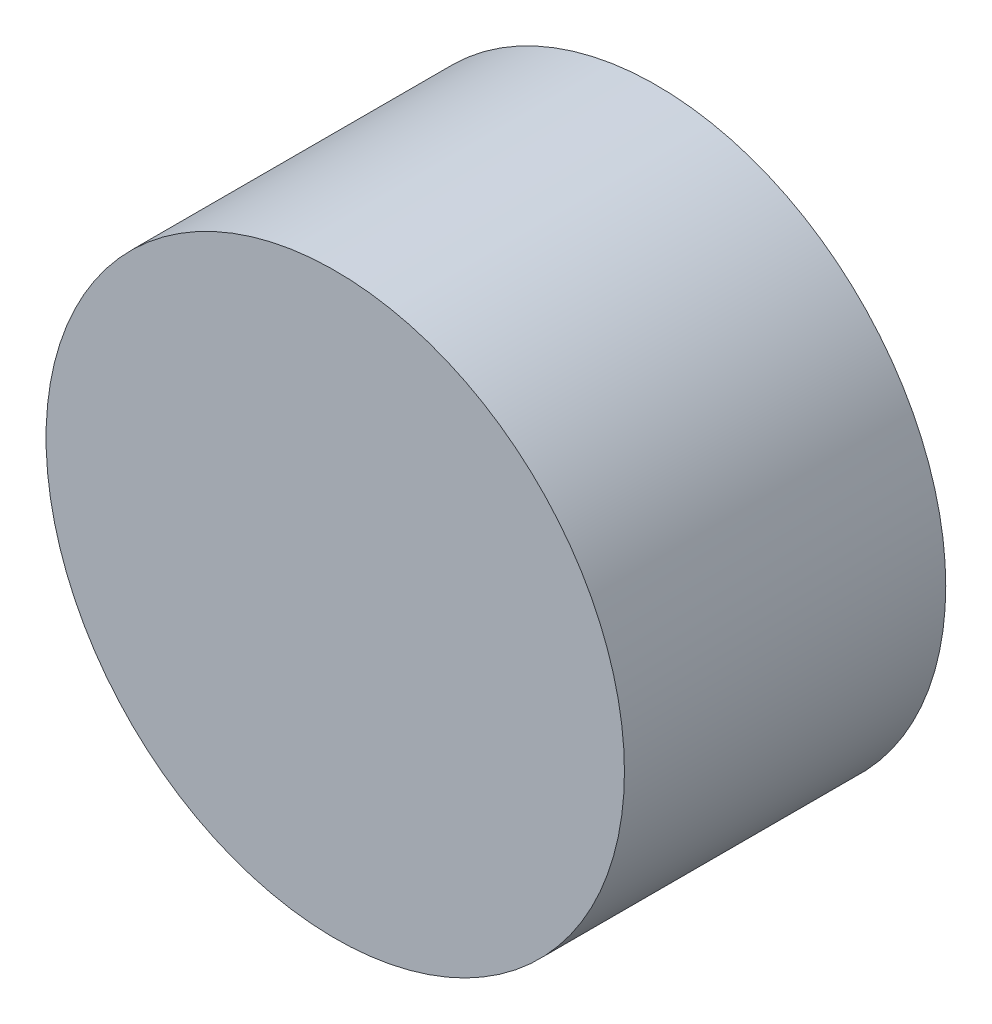
ISO-10303-21;
HEADER;
FILE_DESCRIPTION(('STEP AP214'),'2;1');
FILE_NAME('part.step','',(''),(''),'','','');
FILE_SCHEMA(('AUTOMOTIVE_DESIGN { 1 0 10303 214 1 1 1 1 }'));
ENDSEC;
DATA;
#1=APPLICATION_CONTEXT('core data for automotive mechanical design processes');
#2=APPLICATION_PROTOCOL_DEFINITION('international standard','automotive_design',2000,#1);
#3=PRODUCT_CONTEXT('',#1,'mechanical');
#4=PRODUCT('Part','Part','',(#3));
#5=PRODUCT_RELATED_PRODUCT_CATEGORY('part','',(#4));
#6=PRODUCT_DEFINITION_FORMATION('','',#4);
#7=PRODUCT_DEFINITION_CONTEXT('part definition',#1,'design');
#8=PRODUCT_DEFINITION('design','',#6,#7);
#9=PRODUCT_DEFINITION_SHAPE('','',#8);
#10=(LENGTH_UNIT() NAMED_UNIT(*) SI_UNIT(.MILLI.,.METRE.));
#11=(NAMED_UNIT(*) PLANE_ANGLE_UNIT() SI_UNIT($,.RADIAN.));
#12=(NAMED_UNIT(*) SI_UNIT($,.STERADIAN.) SOLID_ANGLE_UNIT());
#13=UNCERTAINTY_MEASURE_WITH_UNIT(LENGTH_MEASURE(1.E-05),#10,'distance_accuracy_value','');
#14=(GEOMETRIC_REPRESENTATION_CONTEXT(3) GLOBAL_UNCERTAINTY_ASSIGNED_CONTEXT((#13)) GLOBAL_UNIT_ASSIGNED_CONTEXT((#10,
#11,#12)) REPRESENTATION_CONTEXT('',''));
#15=CARTESIAN_POINT('',(0.,0.,0.));
#16=DIRECTION('',(0.,0.,1.));
#17=DIRECTION('',(1.,0.,0.));
#18=AXIS2_PLACEMENT_3D('',#15,#16,#17);
#19=CARTESIAN_POINT('',(0.,0.,10.));
#20=DIRECTION('',(0.,0.,-1.));
#21=DIRECTION('',(-1.,0.,0.));
#22=AXIS2_PLACEMENT_3D('',#19,#20,#21);
#23=CYLINDRICAL_SURFACE('',#22,9.);
#24=CARTESIAN_POINT('',(0.,0.,10.));
#25=DIRECTION('',(0.,0.,1.));
#26=DIRECTION('',(1.,0.,0.));
#27=AXIS2_PLACEMENT_3D('',#24,#25,#26);
#28=CIRCLE('',#27,9.);
#29=CARTESIAN_POINT('',(9.,0.,10.));
#30=VERTEX_POINT('',#29);
#31=EDGE_CURVE('E10',#30,#30,#28,.T.);
#32=ORIENTED_EDGE('',*,*,#31,.F.);
#33=EDGE_LOOP('',(#32));
#34=FACE_BOUND('',#33,.T.);
#35=CARTESIAN_POINT('',(0.,0.,0.));
#36=DIRECTION('',(0.,0.,1.));
#37=DIRECTION('',(1.,0.,0.));
#38=AXIS2_PLACEMENT_3D('',#35,#36,#37);
#39=CIRCLE('',#38,9.);
#40=CARTESIAN_POINT('',(9.,0.,0.));
#41=VERTEX_POINT('',#40);
#42=EDGE_CURVE('E34',#41,#41,#39,.T.);
#43=ORIENTED_EDGE('',*,*,#42,.T.);
#44=EDGE_LOOP('',(#43));
#45=FACE_BOUND('',#44,.T.);
#46=ADVANCED_FACE('F31',(#34,#45),#23,.T.);
#47=CARTESIAN_POINT('',(0.,0.,10.));
#48=DIRECTION('',(0.,0.,1.));
#49=DIRECTION('',(1.,0.,0.));
#50=AXIS2_PLACEMENT_3D('',#47,#48,#49);
#51=PLANE('',#50);
#52=ORIENTED_EDGE('',*,*,#31,.T.);
#53=EDGE_LOOP('',(#52));
#54=FACE_BOUND('',#53,.T.);
#55=ADVANCED_FACE('F60',(#54),#51,.T.);
#56=CARTESIAN_POINT('',(0.,0.,0.));
#57=DIRECTION('',(0.,0.,1.));
#58=DIRECTION('',(1.,0.,0.));
#59=AXIS2_PLACEMENT_3D('',#56,#57,#58);
#60=PLANE('',#59);
#61=CARTESIAN_POINT('',(0.,0.,0.));
#62=DIRECTION('',(0.,0.,-1.));
#63=DIRECTION('',(-1.,0.,0.));
#64=AXIS2_PLACEMENT_3D('',#61,#62,#63);
#65=CIRCLE('',#64,3.);
#66=CARTESIAN_POINT('',(-3.,0.,0.));
#67=VERTEX_POINT('',#66);
#68=EDGE_CURVE('E43',#67,#67,#65,.T.);
#69=ORIENTED_EDGE('',*,*,#68,.F.);
#70=EDGE_LOOP('',(#69));
#71=FACE_BOUND('',#70,.T.);
#72=ORIENTED_EDGE('',*,*,#42,.F.);
#73=EDGE_LOOP('',(#72));
#74=FACE_BOUND('',#73,.T.);
#75=ADVANCED_FACE('F54',(#71,#74),#60,.F.);
#76=CARTESIAN_POINT('',(0.,0.,8.));
#77=DIRECTION('',(0.,0.,-1.));
#78=DIRECTION('',(-1.,0.,0.));
#79=AXIS2_PLACEMENT_3D('',#76,#77,#78);
#80=CYLINDRICAL_SURFACE('',#79,3.);
#81=CARTESIAN_POINT('',(0.,0.,8.));
#82=DIRECTION('',(0.,0.,-1.));
#83=DIRECTION('',(-1.,0.,0.));
#84=AXIS2_PLACEMENT_3D('',#81,#82,#83);
#85=CIRCLE('',#84,3.);
#86=CARTESIAN_POINT('',(-3.,0.,8.));
#87=VERTEX_POINT('',#86);
#88=EDGE_CURVE('E41',#87,#87,#85,.T.);
#89=ORIENTED_EDGE('',*,*,#88,.F.);
#90=EDGE_LOOP('',(#89));
#91=FACE_BOUND('',#90,.T.);
#92=ORIENTED_EDGE('',*,*,#68,.T.);
#93=EDGE_LOOP('',(#92));
#94=FACE_BOUND('',#93,.T.);
#95=ADVANCED_FACE('F51',(#91,#94),#80,.F.);
#96=CARTESIAN_POINT('',(0.,0.,8.));
#97=DIRECTION('',(0.,0.,-1.));
#98=DIRECTION('',(-1.,0.,0.));
#99=AXIS2_PLACEMENT_3D('',#96,#97,#98);
#100=PLANE('',#99);
#101=ORIENTED_EDGE('',*,*,#88,.T.);
#102=EDGE_LOOP('',(#101));
#103=FACE_BOUND('',#102,.T.);
#104=ADVANCED_FACE('F49',(#103),#100,.T.);
#105=CLOSED_SHELL('',(#46,#55,#75,#95,#104));
#106=MANIFOLD_SOLID_BREP('B2',#105);
#107=ADVANCED_BREP_SHAPE_REPRESENTATION('',(#18,#106),#14);
#108=SHAPE_DEFINITION_REPRESENTATION(#9,#107);
ENDSEC;
END-ISO-10303-21;
